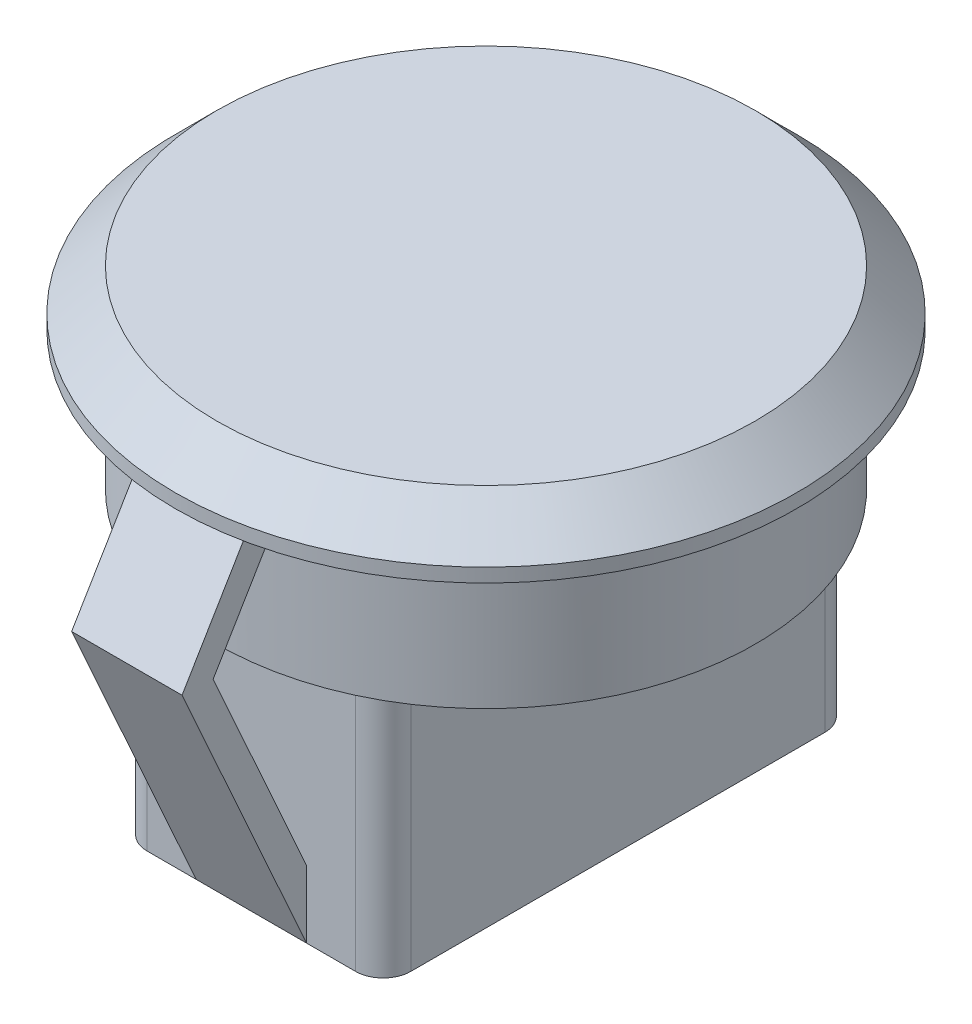
ISO-10303-21;
HEADER;
FILE_DESCRIPTION(('STEP AP214'),'2;1');
FILE_NAME('part.step','',(''),(''),'','','');
FILE_SCHEMA(('AUTOMOTIVE_DESIGN { 1 0 10303 214 1 1 1 1 }'));
ENDSEC;
DATA;
#1=APPLICATION_CONTEXT('core data for automotive mechanical design processes');
#2=APPLICATION_PROTOCOL_DEFINITION('international standard','automotive_design',2000,#1);
#3=PRODUCT_CONTEXT('',#1,'mechanical');
#4=PRODUCT('Part','Part','',(#3));
#5=PRODUCT_RELATED_PRODUCT_CATEGORY('part','',(#4));
#6=PRODUCT_DEFINITION_FORMATION('','',#4);
#7=PRODUCT_DEFINITION_CONTEXT('part definition',#1,'design');
#8=PRODUCT_DEFINITION('design','',#6,#7);
#9=PRODUCT_DEFINITION_SHAPE('','',#8);
#10=(LENGTH_UNIT() NAMED_UNIT(*) SI_UNIT(.MILLI.,.METRE.));
#11=(NAMED_UNIT(*) PLANE_ANGLE_UNIT() SI_UNIT($,.RADIAN.));
#12=(NAMED_UNIT(*) SI_UNIT($,.STERADIAN.) SOLID_ANGLE_UNIT());
#13=UNCERTAINTY_MEASURE_WITH_UNIT(LENGTH_MEASURE(1.E-05),#10,'distance_accuracy_value','');
#14=(GEOMETRIC_REPRESENTATION_CONTEXT(3) GLOBAL_UNCERTAINTY_ASSIGNED_CONTEXT((#13)) GLOBAL_UNIT_ASSIGNED_CONTEXT((#10,
#11,#12)) REPRESENTATION_CONTEXT('',''));
#15=CARTESIAN_POINT('',(0.,0.,0.));
#16=DIRECTION('',(0.,0.,1.));
#17=DIRECTION('',(1.,0.,0.));
#18=AXIS2_PLACEMENT_3D('',#15,#16,#17);
#19=CARTESIAN_POINT('',(-4.7762432936357,-9.,-8.5));
#20=DIRECTION('',(0.,0.,1.));
#21=DIRECTION('',(1.,0.,0.));
#22=AXIS2_PLACEMENT_3D('',#19,#20,#21);
#23=PLANE('',#22);
#24=DIRECTION('',(0.,-1.,0.));
#25=VECTOR('',#24,1.);
#26=CARTESIAN_POINT('',(2.,-9.,-8.5));
#27=LINE('',#26,#25);
#28=CARTESIAN_POINT('',(2.,-6.56117762330623,-8.5));
#29=VERTEX_POINT('',#28);
#30=CARTESIAN_POINT('',(2.,-9.,-8.5));
#31=VERTEX_POINT('',#30);
#32=EDGE_CURVE('E247',#29,#31,#27,.T.);
#33=ORIENTED_EDGE('',*,*,#32,.F.);
#34=DIRECTION('',(1.,0.,0.));
#35=VECTOR('',#34,1.);
#36=CARTESIAN_POINT('',(-4.7762432936357,-6.56117762330622,-8.5));
#37=LINE('',#36,#35);
#38=CARTESIAN_POINT('',(-2.,-6.56117762330623,-8.5));
#39=VERTEX_POINT('',#38);
#40=EDGE_CURVE('E11',#39,#29,#37,.T.);
#41=ORIENTED_EDGE('',*,*,#40,.F.);
#42=DIRECTION('',(0.,-1.,0.));
#43=VECTOR('',#42,1.);
#44=CARTESIAN_POINT('',(-2.,-9.,-8.5));
#45=LINE('',#44,#43);
#46=CARTESIAN_POINT('',(-2.,-9.,-8.50000000000006));
#47=VERTEX_POINT('',#46);
#48=EDGE_CURVE('E241',#39,#47,#45,.T.);
#49=ORIENTED_EDGE('',*,*,#48,.T.);
#50=DIRECTION('',(1.,0.,0.));
#51=VECTOR('',#50,1.);
#52=CARTESIAN_POINT('',(-4.7762432936357,-9.,-8.5));
#53=LINE('',#52,#51);
#54=CARTESIAN_POINT('',(-3.77624329363569,-9.,-8.5));
#55=VERTEX_POINT('',#54);
#56=EDGE_CURVE('E317',#55,#47,#53,.T.);
#57=ORIENTED_EDGE('',*,*,#56,.F.);
#58=DIRECTION('',(0.,1.,0.));
#59=VECTOR('',#58,1.);
#60=CARTESIAN_POINT('',(-3.77624329363569,-9.,-8.5));
#61=LINE('',#60,#59);
#62=CARTESIAN_POINT('',(-3.77624329363569,0.,-8.5));
#63=VERTEX_POINT('',#62);
#64=EDGE_CURVE('E407',#55,#63,#61,.T.);
#65=ORIENTED_EDGE('',*,*,#64,.T.);
#66=DIRECTION('',(1.,0.,0.));
#67=VECTOR('',#66,1.);
#68=CARTESIAN_POINT('',(-4.7762432936357,0.,-8.5));
#69=LINE('',#68,#67);
#70=CARTESIAN_POINT('',(3.77624329363569,0.,-8.5));
#71=VERTEX_POINT('',#70);
#72=EDGE_CURVE('E333',#63,#71,#69,.T.);
#73=ORIENTED_EDGE('',*,*,#72,.T.);
#74=DIRECTION('',(0.,1.,0.));
#75=VECTOR('',#74,1.);
#76=CARTESIAN_POINT('',(3.77624329363569,-9.,-8.5));
#77=LINE('',#76,#75);
#78=CARTESIAN_POINT('',(3.77624329363569,-9.,-8.5));
#79=VERTEX_POINT('',#78);
#80=EDGE_CURVE('E411',#71,#79,#77,.F.);
#81=ORIENTED_EDGE('',*,*,#80,.T.);
#82=EDGE_CURVE('E315',#31,#79,#53,.T.);
#83=ORIENTED_EDGE('',*,*,#82,.F.);
#84=EDGE_LOOP('',(#33,#41,#49,#57,#65,#73,#81,#83));
#85=FACE_BOUND('',#84,.T.);
#86=ADVANCED_FACE('F39',(#85),#23,.F.);
#87=CARTESIAN_POINT('',(-4.7762432936357,-9.,8.5));
#88=DIRECTION('',(0.,0.,-1.));
#89=DIRECTION('',(-1.,0.,0.));
#90=AXIS2_PLACEMENT_3D('',#87,#88,#89);
#91=PLANE('',#90);
#92=DIRECTION('',(0.,1.,0.));
#93=VECTOR('',#92,1.);
#94=CARTESIAN_POINT('',(2.,-9.,8.5));
#95=LINE('',#94,#93);
#96=CARTESIAN_POINT('',(2.,-9.,8.5));
#97=VERTEX_POINT('',#96);
#98=CARTESIAN_POINT('',(2.,-6.56117762330623,8.5));
#99=VERTEX_POINT('',#98);
#100=EDGE_CURVE('E307',#97,#99,#95,.T.);
#101=ORIENTED_EDGE('',*,*,#100,.F.);
#102=DIRECTION('',(-1.,0.,0.));
#103=VECTOR('',#102,1.);
#104=CARTESIAN_POINT('',(-4.7762432936357,-9.,8.5));
#105=LINE('',#104,#103);
#106=CARTESIAN_POINT('',(3.77624329363569,-9.,8.5));
#107=VERTEX_POINT('',#106);
#108=EDGE_CURVE('E326',#107,#97,#105,.T.);
#109=ORIENTED_EDGE('',*,*,#108,.F.);
#110=DIRECTION('',(0.,1.,0.));
#111=VECTOR('',#110,1.);
#112=CARTESIAN_POINT('',(3.77624329363569,-9.,8.5));
#113=LINE('',#112,#111);
#114=CARTESIAN_POINT('',(3.77624329363569,0.,8.5));
#115=VERTEX_POINT('',#114);
#116=EDGE_CURVE('E438',#107,#115,#113,.T.);
#117=ORIENTED_EDGE('',*,*,#116,.T.);
#118=DIRECTION('',(-1.,0.,0.));
#119=VECTOR('',#118,1.);
#120=CARTESIAN_POINT('',(-4.7762432936357,0.,8.5));
#121=LINE('',#120,#119);
#122=CARTESIAN_POINT('',(-3.77624329363569,0.,8.5));
#123=VERTEX_POINT('',#122);
#124=EDGE_CURVE('E316',#115,#123,#121,.T.);
#125=ORIENTED_EDGE('',*,*,#124,.T.);
#126=DIRECTION('',(0.,1.,0.));
#127=VECTOR('',#126,1.);
#128=CARTESIAN_POINT('',(-3.77624329363569,-9.,8.5));
#129=LINE('',#128,#127);
#130=CARTESIAN_POINT('',(-3.77624329363569,-9.,8.5));
#131=VERTEX_POINT('',#130);
#132=EDGE_CURVE('E434',#123,#131,#129,.F.);
#133=ORIENTED_EDGE('',*,*,#132,.T.);
#134=CARTESIAN_POINT('',(-2.,-9.,8.5));
#135=VERTEX_POINT('',#134);
#136=EDGE_CURVE('E325',#135,#131,#105,.T.);
#137=ORIENTED_EDGE('',*,*,#136,.F.);
#138=DIRECTION('',(0.,1.,0.));
#139=VECTOR('',#138,1.);
#140=CARTESIAN_POINT('',(-2.,-9.,8.5));
#141=LINE('',#140,#139);
#142=CARTESIAN_POINT('',(-2.,-6.56117762330623,8.5));
#143=VERTEX_POINT('',#142);
#144=EDGE_CURVE('E303',#135,#143,#141,.T.);
#145=ORIENTED_EDGE('',*,*,#144,.T.);
#146=DIRECTION('',(-1.,0.,0.));
#147=VECTOR('',#146,1.);
#148=CARTESIAN_POINT('',(-4.7762432936357,-6.56117762330622,8.5));
#149=LINE('',#148,#147);
#150=EDGE_CURVE('E48',#99,#143,#149,.T.);
#151=ORIENTED_EDGE('',*,*,#150,.F.);
#152=EDGE_LOOP('',(#101,#109,#117,#125,#133,#137,#145,#151));
#153=FACE_BOUND('',#152,.T.);
#154=ADVANCED_FACE('F471',(#153),#91,.F.);
#155=CARTESIAN_POINT('',(0.,0.,0.));
#156=DIRECTION('',(0.,1.,0.));
#157=DIRECTION('',(0.,0.,1.));
#158=AXIS2_PLACEMENT_3D('',#155,#156,#157);
#159=PLANE('',#158);
#160=CARTESIAN_POINT('',(0.,0.,0.));
#161=DIRECTION('',(0.,1.,0.));
#162=DIRECTION('',(0.,0.,1.));
#163=AXIS2_PLACEMENT_3D('',#160,#161,#162);
#164=CIRCLE('',#163,9.75);
#165=CARTESIAN_POINT('',(-4.7762432936357,0.,8.5));
#166=VERTEX_POINT('',#165);
#167=CARTESIAN_POINT('',(4.7762432936357,0.,8.5));
#168=VERTEX_POINT('',#167);
#169=EDGE_CURVE('E374',#166,#168,#164,.T.);
#170=ORIENTED_EDGE('',*,*,#169,.F.);
#171=CARTESIAN_POINT('',(-9.69858237063541,0.,0.999999999999997));
#172=VERTEX_POINT('',#171);
#173=EDGE_CURVE('E370',#172,#166,#164,.T.);
#174=ORIENTED_EDGE('',*,*,#173,.F.);
#175=DIRECTION('',(1.,0.,0.));
#176=VECTOR('',#175,1.);
#177=CARTESIAN_POINT('',(-10.75,0.,1.));
#178=LINE('',#177,#176);
#179=CARTESIAN_POINT('',(-10.75,0.,1.));
#180=VERTEX_POINT('',#179);
#181=EDGE_CURVE('E366',#180,#172,#178,.T.);
#182=ORIENTED_EDGE('',*,*,#181,.F.);
#183=DIRECTION('',(0.,0.,1.));
#184=VECTOR('',#183,1.);
#185=CARTESIAN_POINT('',(-10.75,0.,-1.));
#186=LINE('',#185,#184);
#187=CARTESIAN_POINT('',(-10.75,0.,-1.));
#188=VERTEX_POINT('',#187);
#189=EDGE_CURVE('E344',#188,#180,#186,.T.);
#190=ORIENTED_EDGE('',*,*,#189,.F.);
#191=DIRECTION('',(-1.,0.,0.));
#192=VECTOR('',#191,1.);
#193=CARTESIAN_POINT('',(-10.75,0.,-1.));
#194=LINE('',#193,#192);
#195=CARTESIAN_POINT('',(-9.69858237063541,0.,-1.));
#196=VERTEX_POINT('',#195);
#197=EDGE_CURVE('E350',#196,#188,#194,.T.);
#198=ORIENTED_EDGE('',*,*,#197,.F.);
#199=CARTESIAN_POINT('',(-4.7762432936357,0.,-8.5));
#200=VERTEX_POINT('',#199);
#201=EDGE_CURVE('E369',#200,#196,#164,.T.);
#202=ORIENTED_EDGE('',*,*,#201,.F.);
#203=CARTESIAN_POINT('',(4.7762432936357,0.,-8.5));
#204=VERTEX_POINT('',#203);
#205=EDGE_CURVE('E843',#204,#200,#164,.T.);
#206=ORIENTED_EDGE('',*,*,#205,.F.);
#207=EDGE_CURVE('E846',#168,#204,#164,.T.);
#208=ORIENTED_EDGE('',*,*,#207,.F.);
#209=EDGE_LOOP('',(#170,#174,#182,#190,#198,#202,#206,#208));
#210=FACE_BOUND('',#209,.T.);
#211=ORIENTED_EDGE('',*,*,#124,.F.);
#212=CARTESIAN_POINT('',(3.77624329363569,0.,7.5));
#213=DIRECTION('',(0.,1.,0.));
#214=DIRECTION('',(0.,0.,1.));
#215=AXIS2_PLACEMENT_3D('',#212,#213,#214);
#216=CIRCLE('',#215,1.);
#217=CARTESIAN_POINT('',(4.7762432936357,0.,7.5));
#218=VERTEX_POINT('',#217);
#219=EDGE_CURVE('E450',#115,#218,#216,.T.);
#220=ORIENTED_EDGE('',*,*,#219,.T.);
#221=DIRECTION('',(0.,0.,1.));
#222=VECTOR('',#221,1.);
#223=CARTESIAN_POINT('',(4.7762432936357,0.,8.5));
#224=LINE('',#223,#222);
#225=CARTESIAN_POINT('',(4.7762432936357,0.,-7.5));
#226=VERTEX_POINT('',#225);
#227=EDGE_CURVE('E336',#226,#218,#224,.T.);
#228=ORIENTED_EDGE('',*,*,#227,.F.);
#229=CARTESIAN_POINT('',(3.77624329363569,0.,-7.5));
#230=DIRECTION('',(0.,1.,0.));
#231=DIRECTION('',(0.,0.,1.));
#232=AXIS2_PLACEMENT_3D('',#229,#230,#231);
#233=CIRCLE('',#232,1.);
#234=EDGE_CURVE('E442',#226,#71,#233,.T.);
#235=ORIENTED_EDGE('',*,*,#234,.T.);
#236=ORIENTED_EDGE('',*,*,#72,.F.);
#237=CARTESIAN_POINT('',(-3.77624329363569,0.,-7.5));
#238=DIRECTION('',(0.,1.,0.));
#239=DIRECTION('',(0.,0.,1.));
#240=AXIS2_PLACEMENT_3D('',#237,#238,#239);
#241=CIRCLE('',#240,1.);
#242=CARTESIAN_POINT('',(-4.7762432936357,0.,-7.5));
#243=VERTEX_POINT('',#242);
#244=EDGE_CURVE('E446',#63,#243,#241,.T.);
#245=ORIENTED_EDGE('',*,*,#244,.T.);
#246=DIRECTION('',(0.,0.,-1.));
#247=VECTOR('',#246,1.);
#248=CARTESIAN_POINT('',(-4.7762432936357,0.,8.5));
#249=LINE('',#248,#247);
#250=CARTESIAN_POINT('',(-4.7762432936357,0.,7.5));
#251=VERTEX_POINT('',#250);
#252=EDGE_CURVE('E310',#251,#243,#249,.T.);
#253=ORIENTED_EDGE('',*,*,#252,.F.);
#254=CARTESIAN_POINT('',(-3.77624329363569,0.,7.5));
#255=DIRECTION('',(0.,1.,0.));
#256=DIRECTION('',(0.,0.,1.));
#257=AXIS2_PLACEMENT_3D('',#254,#255,#256);
#258=CIRCLE('',#257,1.);
#259=EDGE_CURVE('E454',#251,#123,#258,.T.);
#260=ORIENTED_EDGE('',*,*,#259,.T.);
#261=EDGE_LOOP('',(#211,#220,#228,#235,#236,#245,#253,#260));
#262=FACE_BOUND('',#261,.T.);
#263=ADVANCED_FACE('F511',(#210,#262),#159,.F.);
#264=CARTESIAN_POINT('',(-10.75,5.,-1.));
#265=DIRECTION('',(1.,0.,0.));
#266=DIRECTION('',(0.,0.,-1.));
#267=AXIS2_PLACEMENT_3D('',#264,#265,#266);
#268=PLANE('',#267);
#269=ORIENTED_EDGE('',*,*,#189,.T.);
#270=DIRECTION('',(0.,-1.,0.));
#271=VECTOR('',#270,1.);
#272=CARTESIAN_POINT('',(-10.75,5.,1.));
#273=LINE('',#272,#271);
#274=CARTESIAN_POINT('',(-10.75,5.,1.));
#275=VERTEX_POINT('',#274);
#276=EDGE_CURVE('E388',#275,#180,#273,.T.);
#277=ORIENTED_EDGE('',*,*,#276,.F.);
#278=DIRECTION('',(0.,0.,1.));
#279=VECTOR('',#278,1.);
#280=CARTESIAN_POINT('',(-10.75,5.,-1.));
#281=LINE('',#280,#279);
#282=CARTESIAN_POINT('',(-10.75,5.,-1.));
#283=VERTEX_POINT('',#282);
#284=EDGE_CURVE('E345',#283,#275,#281,.T.);
#285=ORIENTED_EDGE('',*,*,#284,.F.);
#286=DIRECTION('',(0.,-1.,0.));
#287=VECTOR('',#286,1.);
#288=CARTESIAN_POINT('',(-10.75,5.,-1.));
#289=LINE('',#288,#287);
#290=EDGE_CURVE('E362',#283,#188,#289,.T.);
#291=ORIENTED_EDGE('',*,*,#290,.T.);
#292=EDGE_LOOP('',(#269,#277,#285,#291));
#293=FACE_BOUND('',#292,.T.);
#294=ADVANCED_FACE('F536',(#293),#268,.F.);
#295=CARTESIAN_POINT('',(-10.75,5.,1.));
#296=DIRECTION('',(0.,0.,-1.));
#297=DIRECTION('',(-1.,0.,0.));
#298=AXIS2_PLACEMENT_3D('',#295,#296,#297);
#299=PLANE('',#298);
#300=ORIENTED_EDGE('',*,*,#181,.T.);
#301=DIRECTION('',(0.,-1.,0.));
#302=VECTOR('',#301,1.);
#303=CARTESIAN_POINT('',(-9.69858237063541,5.,0.999999999999997));
#304=LINE('',#303,#302);
#305=CARTESIAN_POINT('',(-9.69858237063541,5.,0.999999999999997));
#306=VERTEX_POINT('',#305);
#307=EDGE_CURVE('E384',#306,#172,#304,.T.);
#308=ORIENTED_EDGE('',*,*,#307,.F.);
#309=DIRECTION('',(1.,0.,0.));
#310=VECTOR('',#309,1.);
#311=CARTESIAN_POINT('',(-10.75,5.,1.));
#312=LINE('',#311,#310);
#313=EDGE_CURVE('E349',#275,#306,#312,.T.);
#314=ORIENTED_EDGE('',*,*,#313,.F.);
#315=ORIENTED_EDGE('',*,*,#276,.T.);
#316=EDGE_LOOP('',(#300,#308,#314,#315));
#317=FACE_BOUND('',#316,.T.);
#318=ADVANCED_FACE('F544',(#317),#299,.F.);
#319=CARTESIAN_POINT('',(0.,5.,0.));
#320=DIRECTION('',(0.,-1.,0.));
#321=DIRECTION('',(0.,0.,-1.));
#322=AXIS2_PLACEMENT_3D('',#319,#320,#321);
#323=CYLINDRICAL_SURFACE('',#322,9.75);
#324=ORIENTED_EDGE('',*,*,#173,.T.);
#325=ORIENTED_EDGE('',*,*,#169,.T.);
#326=ORIENTED_EDGE('',*,*,#207,.T.);
#327=ORIENTED_EDGE('',*,*,#205,.T.);
#328=ORIENTED_EDGE('',*,*,#201,.T.);
#329=DIRECTION('',(0.,-1.,0.));
#330=VECTOR('',#329,1.);
#331=CARTESIAN_POINT('',(-9.69858237063541,5.,-1.));
#332=LINE('',#331,#330);
#333=CARTESIAN_POINT('',(-9.69858237063541,5.,-1.));
#334=VERTEX_POINT('',#333);
#335=EDGE_CURVE('E380',#334,#196,#332,.T.);
#336=ORIENTED_EDGE('',*,*,#335,.F.);
#337=CARTESIAN_POINT('',(0.,5.,0.));
#338=DIRECTION('',(0.,1.,0.));
#339=DIRECTION('',(0.,0.,1.));
#340=AXIS2_PLACEMENT_3D('',#337,#338,#339);
#341=CIRCLE('',#340,9.75);
#342=EDGE_CURVE('E354',#306,#334,#341,.T.);
#343=ORIENTED_EDGE('',*,*,#342,.F.);
#344=ORIENTED_EDGE('',*,*,#307,.T.);
#345=EDGE_LOOP('',(#324,#325,#326,#327,#328,#336,#343,#344));
#346=FACE_BOUND('',#345,.T.);
#347=ADVANCED_FACE('F540',(#346),#323,.T.);
#348=CARTESIAN_POINT('',(-10.75,5.,-1.));
#349=DIRECTION('',(0.,0.,1.));
#350=DIRECTION('',(1.,0.,0.));
#351=AXIS2_PLACEMENT_3D('',#348,#349,#350);
#352=PLANE('',#351);
#353=ORIENTED_EDGE('',*,*,#197,.T.);
#354=ORIENTED_EDGE('',*,*,#290,.F.);
#355=DIRECTION('',(-1.,0.,0.));
#356=VECTOR('',#355,1.);
#357=CARTESIAN_POINT('',(-10.75,5.,-1.));
#358=LINE('',#357,#356);
#359=EDGE_CURVE('E358',#334,#283,#358,.T.);
#360=ORIENTED_EDGE('',*,*,#359,.F.);
#361=ORIENTED_EDGE('',*,*,#335,.T.);
#362=EDGE_LOOP('',(#353,#354,#360,#361));
#363=FACE_BOUND('',#362,.T.);
#364=ADVANCED_FACE('F529',(#363),#352,.F.);
#365=CARTESIAN_POINT('',(0.,5.,0.));
#366=DIRECTION('',(0.,1.,0.));
#367=DIRECTION('',(0.,0.,1.));
#368=AXIS2_PLACEMENT_3D('',#365,#366,#367);
#369=PLANE('',#368);
#370=CARTESIAN_POINT('',(0.,5.,0.));
#371=DIRECTION('',(0.,1.,0.));
#372=DIRECTION('',(0.,0.,1.));
#373=AXIS2_PLACEMENT_3D('',#370,#371,#372);
#374=CIRCLE('',#373,11.25);
#375=CARTESIAN_POINT('',(0.,5.,11.25));
#376=VERTEX_POINT('',#375);
#377=EDGE_CURVE('E330',#376,#376,#374,.T.);
#378=ORIENTED_EDGE('',*,*,#377,.F.);
#379=EDGE_LOOP('',(#378));
#380=FACE_BOUND('',#379,.T.);
#381=ORIENTED_EDGE('',*,*,#359,.T.);
#382=ORIENTED_EDGE('',*,*,#284,.T.);
#383=ORIENTED_EDGE('',*,*,#313,.T.);
#384=ORIENTED_EDGE('',*,*,#342,.T.);
#385=EDGE_LOOP('',(#381,#382,#383,#384));
#386=FACE_BOUND('',#385,.T.);
#387=ADVANCED_FACE('F526',(#380,#386),#369,.F.);
#388=CARTESIAN_POINT('',(0.,7.,0.));
#389=DIRECTION('',(0.,-1.,0.));
#390=DIRECTION('',(0.,0.,-1.));
#391=AXIS2_PLACEMENT_3D('',#388,#389,#390);
#392=CYLINDRICAL_SURFACE('',#391,11.25);
#393=CARTESIAN_POINT('',(0.,5.5,0.));
#394=DIRECTION('',(0.,1.,0.));
#395=DIRECTION('',(0.,0.,1.));
#396=AXIS2_PLACEMENT_3D('',#393,#394,#395);
#397=CIRCLE('',#396,11.25);
#398=CARTESIAN_POINT('',(0.,5.5,11.25));
#399=VERTEX_POINT('',#398);
#400=EDGE_CURVE('E396',#399,#399,#397,.F.);
#401=ORIENTED_EDGE('',*,*,#400,.T.);
#402=EDGE_LOOP('',(#401));
#403=FACE_BOUND('',#402,.T.);
#404=ORIENTED_EDGE('',*,*,#377,.T.);
#405=EDGE_LOOP('',(#404));
#406=FACE_BOUND('',#405,.T.);
#407=ADVANCED_FACE('F524',(#403,#406),#392,.T.);
#408=CARTESIAN_POINT('',(0.,7.,0.));
#409=DIRECTION('',(0.,1.,0.));
#410=DIRECTION('',(0.,0.,1.));
#411=AXIS2_PLACEMENT_3D('',#408,#409,#410);
#412=PLANE('',#411);
#413=CARTESIAN_POINT('',(0.,7.,0.));
#414=DIRECTION('',(0.,1.,0.));
#415=DIRECTION('',(0.,0.,1.));
#416=AXIS2_PLACEMENT_3D('',#413,#414,#415);
#417=CIRCLE('',#416,9.75000000000001);
#418=CARTESIAN_POINT('',(0.,7.,9.75000000000001));
#419=VERTEX_POINT('',#418);
#420=EDGE_CURVE('E392',#419,#419,#417,.T.);
#421=ORIENTED_EDGE('',*,*,#420,.T.);
#422=EDGE_LOOP('',(#421));
#423=FACE_BOUND('',#422,.T.);
#424=ADVANCED_FACE('F521',(#423),#412,.T.);
#425=CARTESIAN_POINT('',(0.,7.,0.));
#426=DIRECTION('',(0.,-1.,0.));
#427=DIRECTION('',(0.,0.,-1.));
#428=AXIS2_PLACEMENT_3D('',#425,#426,#427);
#429=CONICAL_SURFACE('',#428,9.75000000000001,0.785398163397447);
#430=ORIENTED_EDGE('',*,*,#400,.F.);
#431=EDGE_LOOP('',(#430));
#432=FACE_BOUND('',#431,.T.);
#433=ORIENTED_EDGE('',*,*,#420,.F.);
#434=EDGE_LOOP('',(#433));
#435=FACE_BOUND('',#434,.T.);
#436=ADVANCED_FACE('F519',(#432,#435),#429,.T.);
#437=CARTESIAN_POINT('',(-4.7762432936357,-9.,8.5));
#438=DIRECTION('',(1.,0.,0.));
#439=DIRECTION('',(0.,0.,-1.));
#440=AXIS2_PLACEMENT_3D('',#437,#438,#439);
#441=PLANE('',#440);
#442=ORIENTED_EDGE('',*,*,#252,.T.);
#443=DIRECTION('',(0.,1.,0.));
#444=VECTOR('',#443,1.);
#445=CARTESIAN_POINT('',(-4.7762432936357,-9.,-7.5));
#446=LINE('',#445,#444);
#447=CARTESIAN_POINT('',(-4.7762432936357,-9.,-7.5));
#448=VERTEX_POINT('',#447);
#449=EDGE_CURVE('E431',#243,#448,#446,.F.);
#450=ORIENTED_EDGE('',*,*,#449,.T.);
#451=DIRECTION('',(0.,0.,-1.));
#452=VECTOR('',#451,1.);
#453=CARTESIAN_POINT('',(-4.7762432936357,-9.,8.5));
#454=LINE('',#453,#452);
#455=CARTESIAN_POINT('',(-4.7762432936357,-9.,7.5));
#456=VERTEX_POINT('',#455);
#457=EDGE_CURVE('E311',#456,#448,#454,.T.);
#458=ORIENTED_EDGE('',*,*,#457,.F.);
#459=DIRECTION('',(0.,1.,0.));
#460=VECTOR('',#459,1.);
#461=CARTESIAN_POINT('',(-4.7762432936357,-9.,7.5));
#462=LINE('',#461,#460);
#463=EDGE_CURVE('E427',#456,#251,#462,.T.);
#464=ORIENTED_EDGE('',*,*,#463,.T.);
#465=EDGE_LOOP('',(#442,#450,#458,#464));
#466=FACE_BOUND('',#465,.T.);
#467=ADVANCED_FACE('F516',(#466),#441,.F.);
#468=CARTESIAN_POINT('',(4.7762432936357,-9.,8.5));
#469=DIRECTION('',(-1.,0.,0.));
#470=DIRECTION('',(0.,0.,1.));
#471=AXIS2_PLACEMENT_3D('',#468,#469,#470);
#472=PLANE('',#471);
#473=DIRECTION('',(0.,0.,1.));
#474=VECTOR('',#473,1.);
#475=CARTESIAN_POINT('',(4.7762432936357,-9.,8.5));
#476=LINE('',#475,#474);
#477=CARTESIAN_POINT('',(4.7762432936357,-9.,-7.5));
#478=VERTEX_POINT('',#477);
#479=CARTESIAN_POINT('',(4.7762432936357,-9.,7.5));
#480=VERTEX_POINT('',#479);
#481=EDGE_CURVE('E321',#478,#480,#476,.T.);
#482=ORIENTED_EDGE('',*,*,#481,.F.);
#483=DIRECTION('',(0.,1.,0.));
#484=VECTOR('',#483,1.);
#485=CARTESIAN_POINT('',(4.7762432936357,-9.,-7.5));
#486=LINE('',#485,#484);
#487=EDGE_CURVE('E403',#478,#226,#486,.T.);
#488=ORIENTED_EDGE('',*,*,#487,.T.);
#489=ORIENTED_EDGE('',*,*,#227,.T.);
#490=DIRECTION('',(0.,1.,0.));
#491=VECTOR('',#490,1.);
#492=CARTESIAN_POINT('',(4.7762432936357,-9.,7.5));
#493=LINE('',#492,#491);
#494=EDGE_CURVE('E400',#218,#480,#493,.F.);
#495=ORIENTED_EDGE('',*,*,#494,.T.);
#496=EDGE_LOOP('',(#482,#488,#489,#495));
#497=FACE_BOUND('',#496,.T.);
#498=ADVANCED_FACE('F515',(#497),#472,.F.);
#499=CARTESIAN_POINT('',(0.,-9.,0.));
#500=DIRECTION('',(0.,-1.,0.));
#501=DIRECTION('',(0.,0.,-1.));
#502=AXIS2_PLACEMENT_3D('',#499,#500,#501);
#503=PLANE('',#502);
#504=ORIENTED_EDGE('',*,*,#56,.T.);
#505=DIRECTION('',(-1.,0.,0.));
#506=VECTOR('',#505,1.);
#507=CARTESIAN_POINT('',(2.,-9.,-8.50000000000006));
#508=LINE('',#507,#506);
#509=EDGE_CURVE('E242',#31,#47,#508,.T.);
#510=ORIENTED_EDGE('',*,*,#509,.F.);
#511=ORIENTED_EDGE('',*,*,#82,.T.);
#512=CARTESIAN_POINT('',(3.77624329363569,-9.,-7.5));
#513=DIRECTION('',(0.,-1.,0.));
#514=DIRECTION('',(0.,0.,-1.));
#515=AXIS2_PLACEMENT_3D('',#512,#513,#514);
#516=CIRCLE('',#515,1.);
#517=EDGE_CURVE('E424',#79,#478,#516,.T.);
#518=ORIENTED_EDGE('',*,*,#517,.T.);
#519=ORIENTED_EDGE('',*,*,#481,.T.);
#520=CARTESIAN_POINT('',(3.77624329363569,-9.,7.5));
#521=DIRECTION('',(0.,-1.,0.));
#522=DIRECTION('',(0.,0.,-1.));
#523=AXIS2_PLACEMENT_3D('',#520,#521,#522);
#524=CIRCLE('',#523,1.);
#525=EDGE_CURVE('E418',#480,#107,#524,.T.);
#526=ORIENTED_EDGE('',*,*,#525,.T.);
#527=ORIENTED_EDGE('',*,*,#108,.T.);
#528=DIRECTION('',(-1.,0.,0.));
#529=VECTOR('',#528,1.);
#530=CARTESIAN_POINT('',(2.,-9.,8.5));
#531=LINE('',#530,#529);
#532=EDGE_CURVE('E271',#97,#135,#531,.T.);
#533=ORIENTED_EDGE('',*,*,#532,.T.);
#534=ORIENTED_EDGE('',*,*,#136,.T.);
#535=CARTESIAN_POINT('',(-3.77624329363569,-9.,7.5));
#536=DIRECTION('',(0.,-1.,0.));
#537=DIRECTION('',(0.,0.,-1.));
#538=AXIS2_PLACEMENT_3D('',#535,#536,#537);
#539=CIRCLE('',#538,1.);
#540=EDGE_CURVE('E415',#131,#456,#539,.T.);
#541=ORIENTED_EDGE('',*,*,#540,.T.);
#542=ORIENTED_EDGE('',*,*,#457,.T.);
#543=CARTESIAN_POINT('',(-3.77624329363569,-9.,-7.5));
#544=DIRECTION('',(0.,-1.,0.));
#545=DIRECTION('',(0.,0.,-1.));
#546=AXIS2_PLACEMENT_3D('',#543,#544,#545);
#547=CIRCLE('',#546,1.);
#548=EDGE_CURVE('E421',#448,#55,#547,.T.);
#549=ORIENTED_EDGE('',*,*,#548,.T.);
#550=EDGE_LOOP('',(#504,#510,#511,#518,#519,#526,#527,#533,#534,#541,#542,#549));
#551=FACE_BOUND('',#550,.T.);
#552=ADVANCED_FACE('F476',(#551),#503,.T.);
#553=CARTESIAN_POINT('',(3.77624329363569,-9.,-7.5));
#554=DIRECTION('',(0.,1.,0.));
#555=DIRECTION('',(0.,0.,1.));
#556=AXIS2_PLACEMENT_3D('',#553,#554,#555);
#557=CYLINDRICAL_SURFACE('',#556,1.);
#558=ORIENTED_EDGE('',*,*,#517,.F.);
#559=ORIENTED_EDGE('',*,*,#80,.F.);
#560=ORIENTED_EDGE('',*,*,#234,.F.);
#561=ORIENTED_EDGE('',*,*,#487,.F.);
#562=EDGE_LOOP('',(#558,#559,#560,#561));
#563=FACE_BOUND('',#562,.T.);
#564=ADVANCED_FACE('F555',(#563),#557,.T.);
#565=CARTESIAN_POINT('',(-3.77624329363569,-9.,-7.5));
#566=DIRECTION('',(0.,1.,0.));
#567=DIRECTION('',(0.,0.,1.));
#568=AXIS2_PLACEMENT_3D('',#565,#566,#567);
#569=CYLINDRICAL_SURFACE('',#568,1.);
#570=ORIENTED_EDGE('',*,*,#548,.F.);
#571=ORIENTED_EDGE('',*,*,#449,.F.);
#572=ORIENTED_EDGE('',*,*,#244,.F.);
#573=ORIENTED_EDGE('',*,*,#64,.F.);
#574=EDGE_LOOP('',(#570,#571,#572,#573));
#575=FACE_BOUND('',#574,.T.);
#576=ADVANCED_FACE('F558',(#575),#569,.T.);
#577=CARTESIAN_POINT('',(3.77624329363569,-9.,7.5));
#578=DIRECTION('',(0.,1.,0.));
#579=DIRECTION('',(0.,0.,1.));
#580=AXIS2_PLACEMENT_3D('',#577,#578,#579);
#581=CYLINDRICAL_SURFACE('',#580,1.);
#582=ORIENTED_EDGE('',*,*,#525,.F.);
#583=ORIENTED_EDGE('',*,*,#494,.F.);
#584=ORIENTED_EDGE('',*,*,#219,.F.);
#585=ORIENTED_EDGE('',*,*,#116,.F.);
#586=EDGE_LOOP('',(#582,#583,#584,#585));
#587=FACE_BOUND('',#586,.T.);
#588=ADVANCED_FACE('F561',(#587),#581,.T.);
#589=CARTESIAN_POINT('',(-3.77624329363569,-9.,7.5));
#590=DIRECTION('',(0.,1.,0.));
#591=DIRECTION('',(0.,0.,1.));
#592=AXIS2_PLACEMENT_3D('',#589,#590,#591);
#593=CYLINDRICAL_SURFACE('',#592,1.);
#594=ORIENTED_EDGE('',*,*,#540,.F.);
#595=ORIENTED_EDGE('',*,*,#132,.F.);
#596=ORIENTED_EDGE('',*,*,#259,.F.);
#597=ORIENTED_EDGE('',*,*,#463,.F.);
#598=EDGE_LOOP('',(#594,#595,#596,#597));
#599=FACE_BOUND('',#598,.T.);
#600=ADVANCED_FACE('F41',(#599),#593,.T.);
#601=CARTESIAN_POINT('',(2.,0.968422681066041,11.8850373058693));
#602=DIRECTION('',(0.,-0.410033961290639,0.912070255291941));
#603=DIRECTION('',(0.,-0.912070255291941,-0.410033961290639));
#604=AXIS2_PLACEMENT_3D('',#601,#602,#603);
#605=PLANE('',#604);
#606=DIRECTION('',(0.,0.912070255291941,0.410033961290639));
#607=VECTOR('',#606,1.);
#608=CARTESIAN_POINT('',(2.,0.968422681066041,11.8850373058693));
#609=LINE('',#608,#607);
#610=CARTESIAN_POINT('',(2.,0.968422681066041,11.8850373058693));
#611=VERTEX_POINT('',#610);
#612=EDGE_CURVE('E256',#99,#611,#609,.T.);
#613=ORIENTED_EDGE('',*,*,#612,.F.);
#614=ORIENTED_EDGE('',*,*,#150,.T.);
#615=DIRECTION('',(0.,0.912070255291941,0.410033961290639));
#616=VECTOR('',#615,1.);
#617=CARTESIAN_POINT('',(-2.,0.968422681066041,11.8850373058693));
#618=LINE('',#617,#616);
#619=CARTESIAN_POINT('',(-2.,0.968422681066041,11.8850373058693));
#620=VERTEX_POINT('',#619);
#621=EDGE_CURVE('E255',#143,#620,#618,.T.);
#622=ORIENTED_EDGE('',*,*,#621,.T.);
#623=DIRECTION('',(-1.,0.,0.));
#624=VECTOR('',#623,1.);
#625=CARTESIAN_POINT('',(2.,0.968422681066041,11.8850373058693));
#626=LINE('',#625,#624);
#627=EDGE_CURVE('E299',#611,#620,#626,.T.);
#628=ORIENTED_EDGE('',*,*,#627,.F.);
#629=EDGE_LOOP('',(#613,#614,#622,#628));
#630=FACE_BOUND('',#629,.T.);
#631=ADVANCED_FACE('F462',(#630),#605,.F.);
#632=CARTESIAN_POINT('',(2.,0.,0.));
#633=DIRECTION('',(-1.,0.,0.));
#634=DIRECTION('',(0.,0.,1.));
#635=AXIS2_PLACEMENT_3D('',#632,#633,#634);
#636=PLANE('',#635);
#637=DIRECTION('',(0.,-0.912070255291941,-0.410033961290639));
#638=VECTOR('',#637,1.);
#639=CARTESIAN_POINT('',(2.,-9.,8.5));
#640=LINE('',#639,#638);
#641=CARTESIAN_POINT('',(2.,1.03277280821136,13.010373574197));
#642=VERTEX_POINT('',#641);
#643=EDGE_CURVE('E268',#642,#97,#640,.T.);
#644=ORIENTED_EDGE('',*,*,#643,.T.);
#645=ORIENTED_EDGE('',*,*,#100,.T.);
#646=ORIENTED_EDGE('',*,*,#612,.T.);
#647=DIRECTION('',(0.,0.859383820397476,-0.5113310563999));
#648=VECTOR('',#647,1.);
#649=CARTESIAN_POINT('',(2.,4.3886689436001,9.85));
#650=LINE('',#649,#648);
#651=CARTESIAN_POINT('',(2.,4.3886689436001,9.85));
#652=VERTEX_POINT('',#651);
#653=EDGE_CURVE('E259',#611,#652,#650,.T.);
#654=ORIENTED_EDGE('',*,*,#653,.T.);
#655=DIRECTION('',(0.,0.511331056399901,0.859383820397476));
#656=VECTOR('',#655,1.);
#657=CARTESIAN_POINT('',(2.,4.9,10.7093838203975));
#658=LINE('',#657,#656);
#659=CARTESIAN_POINT('',(2.,4.9,10.7093838203975));
#660=VERTEX_POINT('',#659);
#661=EDGE_CURVE('E262',#652,#660,#658,.T.);
#662=ORIENTED_EDGE('',*,*,#661,.T.);
#663=DIRECTION('',(0.,-0.859383820397476,0.5113310563999));
#664=VECTOR('',#663,1.);
#665=CARTESIAN_POINT('',(2.,1.03277280821136,13.010373574197));
#666=LINE('',#665,#664);
#667=EDGE_CURVE('E265',#660,#642,#666,.T.);
#668=ORIENTED_EDGE('',*,*,#667,.T.);
#669=EDGE_LOOP('',(#644,#645,#646,#654,#662,#668));
#670=FACE_BOUND('',#669,.T.);
#671=ADVANCED_FACE('F482',(#670),#636,.F.);
#672=CARTESIAN_POINT('',(-2.,0.,0.));
#673=DIRECTION('',(-1.,0.,0.));
#674=DIRECTION('',(0.,0.,1.));
#675=AXIS2_PLACEMENT_3D('',#672,#673,#674);
#676=PLANE('',#675);
#677=ORIENTED_EDGE('',*,*,#144,.F.);
#678=DIRECTION('',(0.,-0.912070255291941,-0.410033961290639));
#679=VECTOR('',#678,1.);
#680=CARTESIAN_POINT('',(-2.,-9.,8.5));
#681=LINE('',#680,#679);
#682=CARTESIAN_POINT('',(-2.,1.03277280821136,13.010373574197));
#683=VERTEX_POINT('',#682);
#684=EDGE_CURVE('E63',#683,#135,#681,.T.);
#685=ORIENTED_EDGE('',*,*,#684,.F.);
#686=DIRECTION('',(0.,-0.859383820397476,0.5113310563999));
#687=VECTOR('',#686,1.);
#688=CARTESIAN_POINT('',(-2.,1.03277280821136,13.010373574197));
#689=LINE('',#688,#687);
#690=CARTESIAN_POINT('',(-2.,4.9,10.7093838203975));
#691=VERTEX_POINT('',#690);
#692=EDGE_CURVE('E280',#691,#683,#689,.T.);
#693=ORIENTED_EDGE('',*,*,#692,.F.);
#694=DIRECTION('',(0.,0.511331056399901,0.859383820397476));
#695=VECTOR('',#694,1.);
#696=CARTESIAN_POINT('',(-2.,4.9,10.7093838203975));
#697=LINE('',#696,#695);
#698=CARTESIAN_POINT('',(-2.,4.3886689436001,9.85));
#699=VERTEX_POINT('',#698);
#700=EDGE_CURVE('E277',#699,#691,#697,.T.);
#701=ORIENTED_EDGE('',*,*,#700,.F.);
#702=DIRECTION('',(0.,0.859383820397476,-0.5113310563999));
#703=VECTOR('',#702,1.);
#704=CARTESIAN_POINT('',(-2.,4.3886689436001,9.85));
#705=LINE('',#704,#703);
#706=EDGE_CURVE('E274',#620,#699,#705,.T.);
#707=ORIENTED_EDGE('',*,*,#706,.F.);
#708=ORIENTED_EDGE('',*,*,#621,.F.);
#709=EDGE_LOOP('',(#677,#685,#693,#701,#707,#708));
#710=FACE_BOUND('',#709,.T.);
#711=ADVANCED_FACE('F468',(#710),#676,.T.);
#712=CARTESIAN_POINT('',(2.,4.3886689436001,9.85));
#713=DIRECTION('',(0.,0.5113310563999,0.859383820397476));
#714=DIRECTION('',(0.,-0.859383820397476,0.5113310563999));
#715=AXIS2_PLACEMENT_3D('',#712,#713,#714);
#716=PLANE('',#715);
#717=ORIENTED_EDGE('',*,*,#706,.T.);
#718=DIRECTION('',(-1.,0.,0.));
#719=VECTOR('',#718,1.);
#720=CARTESIAN_POINT('',(2.,4.3886689436001,9.85));
#721=LINE('',#720,#719);
#722=EDGE_CURVE('E295',#652,#699,#721,.T.);
#723=ORIENTED_EDGE('',*,*,#722,.F.);
#724=ORIENTED_EDGE('',*,*,#653,.F.);
#725=ORIENTED_EDGE('',*,*,#627,.T.);
#726=EDGE_LOOP('',(#717,#723,#724,#725));
#727=FACE_BOUND('',#726,.T.);
#728=ADVANCED_FACE('F495',(#727),#716,.F.);
#729=CARTESIAN_POINT('',(2.,4.9,10.7093838203975));
#730=DIRECTION('',(0.,-0.859383820397476,0.511331056399901));
#731=DIRECTION('',(0.,-0.511331056399901,-0.859383820397476));
#732=AXIS2_PLACEMENT_3D('',#729,#730,#731);
#733=PLANE('',#732);
#734=ORIENTED_EDGE('',*,*,#700,.T.);
#735=DIRECTION('',(-1.,0.,0.));
#736=VECTOR('',#735,1.);
#737=CARTESIAN_POINT('',(2.,4.9,10.7093838203975));
#738=LINE('',#737,#736);
#739=EDGE_CURVE('E291',#660,#691,#738,.T.);
#740=ORIENTED_EDGE('',*,*,#739,.F.);
#741=ORIENTED_EDGE('',*,*,#661,.F.);
#742=ORIENTED_EDGE('',*,*,#722,.T.);
#743=EDGE_LOOP('',(#734,#740,#741,#742));
#744=FACE_BOUND('',#743,.T.);
#745=ADVANCED_FACE('F491',(#744),#733,.F.);
#746=CARTESIAN_POINT('',(2.,1.03277280821136,13.010373574197));
#747=DIRECTION('',(0.,-0.5113310563999,-0.859383820397476));
#748=DIRECTION('',(0.,0.859383820397476,-0.5113310563999));
#749=AXIS2_PLACEMENT_3D('',#746,#747,#748);
#750=PLANE('',#749);
#751=ORIENTED_EDGE('',*,*,#692,.T.);
#752=DIRECTION('',(-1.,0.,0.));
#753=VECTOR('',#752,1.);
#754=CARTESIAN_POINT('',(2.,1.03277280821136,13.010373574197));
#755=LINE('',#754,#753);
#756=EDGE_CURVE('E288',#642,#683,#755,.T.);
#757=ORIENTED_EDGE('',*,*,#756,.F.);
#758=ORIENTED_EDGE('',*,*,#667,.F.);
#759=ORIENTED_EDGE('',*,*,#739,.T.);
#760=EDGE_LOOP('',(#751,#757,#758,#759));
#761=FACE_BOUND('',#760,.T.);
#762=ADVANCED_FACE('F488',(#761),#750,.F.);
#763=CARTESIAN_POINT('',(2.,-9.,8.5));
#764=DIRECTION('',(0.,0.410033961290639,-0.912070255291941));
#765=DIRECTION('',(0.,0.912070255291941,0.410033961290639));
#766=AXIS2_PLACEMENT_3D('',#763,#764,#765);
#767=PLANE('',#766);
#768=ORIENTED_EDGE('',*,*,#684,.T.);
#769=ORIENTED_EDGE('',*,*,#532,.F.);
#770=ORIENTED_EDGE('',*,*,#643,.F.);
#771=ORIENTED_EDGE('',*,*,#756,.T.);
#772=EDGE_LOOP('',(#768,#769,#770,#771));
#773=FACE_BOUND('',#772,.T.);
#774=ADVANCED_FACE('F479',(#773),#767,.F.);
#775=CARTESIAN_POINT('',(2.,0.968422681066041,-11.8850373058693));
#776=DIRECTION('',(0.,-0.410033961290639,-0.912070255291941));
#777=DIRECTION('',(0.,0.912070255291941,-0.410033961290639));
#778=AXIS2_PLACEMENT_3D('',#775,#776,#777);
#779=PLANE('',#778);
#780=DIRECTION('',(0.,-0.912070255291941,0.410033961290639));
#781=VECTOR('',#780,1.);
#782=CARTESIAN_POINT('',(-2.,0.968422681066041,-11.8850373058693));
#783=LINE('',#782,#781);
#784=CARTESIAN_POINT('',(-2.,0.968422681066041,-11.8850373058693));
#785=VERTEX_POINT('',#784);
#786=EDGE_CURVE('E591',#785,#39,#783,.T.);
#787=ORIENTED_EDGE('',*,*,#786,.T.);
#788=ORIENTED_EDGE('',*,*,#40,.T.);
#789=DIRECTION('',(0.,-0.912070255291941,0.410033961290639));
#790=VECTOR('',#789,1.);
#791=CARTESIAN_POINT('',(2.,0.968422681066041,-11.8850373058693));
#792=LINE('',#791,#790);
#793=CARTESIAN_POINT('',(2.,0.968422681066041,-11.8850373058693));
#794=VERTEX_POINT('',#793);
#795=EDGE_CURVE('E214',#794,#29,#792,.T.);
#796=ORIENTED_EDGE('',*,*,#795,.F.);
#797=DIRECTION('',(-1.,0.,0.));
#798=VECTOR('',#797,1.);
#799=CARTESIAN_POINT('',(2.,0.968422681066041,-11.8850373058693));
#800=LINE('',#799,#798);
#801=EDGE_CURVE('E219',#794,#785,#800,.T.);
#802=ORIENTED_EDGE('',*,*,#801,.T.);
#803=EDGE_LOOP('',(#787,#788,#796,#802));
#804=FACE_BOUND('',#803,.T.);
#805=ADVANCED_FACE('F217',(#804),#779,.F.);
#806=CARTESIAN_POINT('',(2.,0.,0.));
#807=DIRECTION('',(-1.,0.,0.));
#808=DIRECTION('',(0.,0.,1.));
#809=AXIS2_PLACEMENT_3D('',#806,#807,#808);
#810=PLANE('',#809);
#811=ORIENTED_EDGE('',*,*,#795,.T.);
#812=ORIENTED_EDGE('',*,*,#32,.T.);
#813=DIRECTION('',(0.,0.912070255291944,-0.410033961290634));
#814=VECTOR('',#813,1.);
#815=CARTESIAN_POINT('',(2.,-9.,-8.50000000000006));
#816=LINE('',#815,#814);
#817=CARTESIAN_POINT('',(2.,1.03277280821136,-13.010373574197));
#818=VERTEX_POINT('',#817);
#819=EDGE_CURVE('E55',#31,#818,#816,.T.);
#820=ORIENTED_EDGE('',*,*,#819,.T.);
#821=DIRECTION('',(0.,0.859383820397476,0.5113310563999));
#822=VECTOR('',#821,1.);
#823=CARTESIAN_POINT('',(2.,1.03277280821136,-13.010373574197));
#824=LINE('',#823,#822);
#825=CARTESIAN_POINT('',(2.,4.9,-10.7093838203975));
#826=VERTEX_POINT('',#825);
#827=EDGE_CURVE('E619',#818,#826,#824,.T.);
#828=ORIENTED_EDGE('',*,*,#827,.T.);
#829=DIRECTION('',(0.,-0.511331056399901,0.859383820397476));
#830=VECTOR('',#829,1.);
#831=CARTESIAN_POINT('',(2.,4.9,-10.7093838203975));
#832=LINE('',#831,#830);
#833=CARTESIAN_POINT('',(2.,4.3886689436001,-9.85));
#834=VERTEX_POINT('',#833);
#835=EDGE_CURVE('E230',#826,#834,#832,.T.);
#836=ORIENTED_EDGE('',*,*,#835,.T.);
#837=DIRECTION('',(0.,-0.859383820397476,-0.5113310563999));
#838=VECTOR('',#837,1.);
#839=CARTESIAN_POINT('',(2.,4.3886689436001,-9.85));
#840=LINE('',#839,#838);
#841=EDGE_CURVE('E225',#834,#794,#840,.T.);
#842=ORIENTED_EDGE('',*,*,#841,.T.);
#843=EDGE_LOOP('',(#811,#812,#820,#828,#836,#842));
#844=FACE_BOUND('',#843,.T.);
#845=ADVANCED_FACE('F228',(#844),#810,.F.);
#846=CARTESIAN_POINT('',(-2.,0.,0.));
#847=DIRECTION('',(-1.,0.,0.));
#848=DIRECTION('',(0.,0.,1.));
#849=AXIS2_PLACEMENT_3D('',#846,#847,#848);
#850=PLANE('',#849);
#851=ORIENTED_EDGE('',*,*,#48,.F.);
#852=ORIENTED_EDGE('',*,*,#786,.F.);
#853=DIRECTION('',(0.,-0.859383820397476,-0.5113310563999));
#854=VECTOR('',#853,1.);
#855=CARTESIAN_POINT('',(-2.,4.3886689436001,-9.85));
#856=LINE('',#855,#854);
#857=CARTESIAN_POINT('',(-2.,4.3886689436001,-9.85));
#858=VERTEX_POINT('',#857);
#859=EDGE_CURVE('E239',#858,#785,#856,.T.);
#860=ORIENTED_EDGE('',*,*,#859,.F.);
#861=DIRECTION('',(0.,-0.511331056399901,0.859383820397476));
#862=VECTOR('',#861,1.);
#863=CARTESIAN_POINT('',(-2.,4.9,-10.7093838203975));
#864=LINE('',#863,#862);
#865=CARTESIAN_POINT('',(-2.,4.9,-10.7093838203975));
#866=VERTEX_POINT('',#865);
#867=EDGE_CURVE('E235',#866,#858,#864,.T.);
#868=ORIENTED_EDGE('',*,*,#867,.F.);
#869=DIRECTION('',(0.,0.859383820397476,0.5113310563999));
#870=VECTOR('',#869,1.);
#871=CARTESIAN_POINT('',(-2.,1.03277280821136,-13.010373574197));
#872=LINE('',#871,#870);
#873=CARTESIAN_POINT('',(-2.,1.03277280821136,-13.010373574197));
#874=VERTEX_POINT('',#873);
#875=EDGE_CURVE('E598',#874,#866,#872,.T.);
#876=ORIENTED_EDGE('',*,*,#875,.F.);
#877=DIRECTION('',(0.,0.912070255291944,-0.410033961290634));
#878=VECTOR('',#877,1.);
#879=CARTESIAN_POINT('',(-2.,-9.,-8.50000000000006));
#880=LINE('',#879,#878);
#881=EDGE_CURVE('E593',#47,#874,#880,.T.);
#882=ORIENTED_EDGE('',*,*,#881,.F.);
#883=EDGE_LOOP('',(#851,#852,#860,#868,#876,#882));
#884=FACE_BOUND('',#883,.T.);
#885=ADVANCED_FACE('F590',(#884),#850,.T.);
#886=CARTESIAN_POINT('',(2.,4.3886689436001,-9.85));
#887=DIRECTION('',(0.,0.5113310563999,-0.859383820397476));
#888=DIRECTION('',(0.,0.859383820397476,0.5113310563999));
#889=AXIS2_PLACEMENT_3D('',#886,#887,#888);
#890=PLANE('',#889);
#891=ORIENTED_EDGE('',*,*,#859,.T.);
#892=ORIENTED_EDGE('',*,*,#801,.F.);
#893=ORIENTED_EDGE('',*,*,#841,.F.);
#894=DIRECTION('',(-1.,0.,0.));
#895=VECTOR('',#894,1.);
#896=CARTESIAN_POINT('',(2.,4.3886689436001,-9.85));
#897=LINE('',#896,#895);
#898=EDGE_CURVE('E607',#834,#858,#897,.T.);
#899=ORIENTED_EDGE('',*,*,#898,.T.);
#900=EDGE_LOOP('',(#891,#892,#893,#899));
#901=FACE_BOUND('',#900,.T.);
#902=ADVANCED_FACE('F237',(#901),#890,.F.);
#903=CARTESIAN_POINT('',(2.,-9.,-8.50000000000006));
#904=DIRECTION('',(0.,0.410033961290634,0.912070255291944));
#905=DIRECTION('',(0.,-0.912070255291943,0.410033961290634));
#906=AXIS2_PLACEMENT_3D('',#903,#904,#905);
#907=PLANE('',#906);
#908=ORIENTED_EDGE('',*,*,#881,.T.);
#909=DIRECTION('',(-1.,0.,0.));
#910=VECTOR('',#909,1.);
#911=CARTESIAN_POINT('',(2.,1.03277280821136,-13.010373574197));
#912=LINE('',#911,#910);
#913=EDGE_CURVE('E249',#818,#874,#912,.T.);
#914=ORIENTED_EDGE('',*,*,#913,.F.);
#915=ORIENTED_EDGE('',*,*,#819,.F.);
#916=ORIENTED_EDGE('',*,*,#509,.T.);
#917=EDGE_LOOP('',(#908,#914,#915,#916));
#918=FACE_BOUND('',#917,.T.);
#919=ADVANCED_FACE('F630',(#918),#907,.F.);
#920=CARTESIAN_POINT('',(2.,1.03277280821136,-13.010373574197));
#921=DIRECTION('',(0.,-0.5113310563999,0.859383820397476));
#922=DIRECTION('',(0.,-0.859383820397476,-0.5113310563999));
#923=AXIS2_PLACEMENT_3D('',#920,#921,#922);
#924=PLANE('',#923);
#925=ORIENTED_EDGE('',*,*,#875,.T.);
#926=DIRECTION('',(-1.,0.,0.));
#927=VECTOR('',#926,1.);
#928=CARTESIAN_POINT('',(2.,4.9,-10.7093838203975));
#929=LINE('',#928,#927);
#930=EDGE_CURVE('E610',#826,#866,#929,.T.);
#931=ORIENTED_EDGE('',*,*,#930,.F.);
#932=ORIENTED_EDGE('',*,*,#827,.F.);
#933=ORIENTED_EDGE('',*,*,#913,.T.);
#934=EDGE_LOOP('',(#925,#931,#932,#933));
#935=FACE_BOUND('',#934,.T.);
#936=ADVANCED_FACE('F617',(#935),#924,.F.);
#937=CARTESIAN_POINT('',(2.,4.9,-10.7093838203975));
#938=DIRECTION('',(0.,-0.859383820397476,-0.511331056399901));
#939=DIRECTION('',(0.,0.511331056399901,-0.859383820397476));
#940=AXIS2_PLACEMENT_3D('',#937,#938,#939);
#941=PLANE('',#940);
#942=ORIENTED_EDGE('',*,*,#867,.T.);
#943=ORIENTED_EDGE('',*,*,#898,.F.);
#944=ORIENTED_EDGE('',*,*,#835,.F.);
#945=ORIENTED_EDGE('',*,*,#930,.T.);
#946=EDGE_LOOP('',(#942,#943,#944,#945));
#947=FACE_BOUND('',#946,.T.);
#948=ADVANCED_FACE('F622',(#947),#941,.F.);
#949=CLOSED_SHELL('',(#86,#154,#263,#294,#318,#347,#364,#387,#407,#424,#436,#467,#498,#552,#564,
#576,#588,#600,#631,#671,#711,#728,#745,#762,#774,#805,#845,#885,#902,#919,#936,#948));
#950=MANIFOLD_SOLID_BREP('B2',#949);
#951=ADVANCED_BREP_SHAPE_REPRESENTATION('',(#18,#950),#14);
#952=SHAPE_DEFINITION_REPRESENTATION(#9,#951);
ENDSEC;
END-ISO-10303-21;
